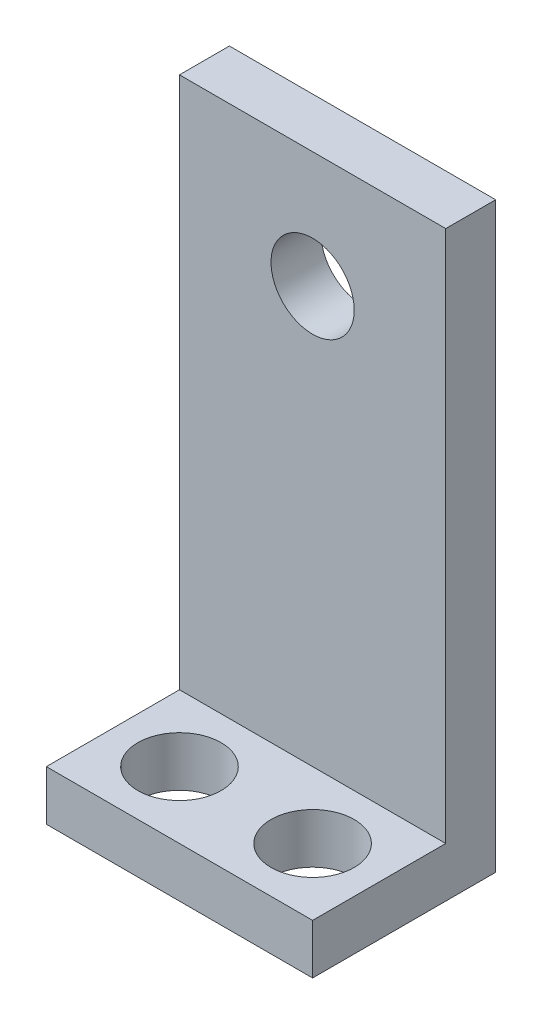
ISO-10303-21;
HEADER;
FILE_DESCRIPTION(('STEP AP214'),'2;1');
FILE_NAME('part.step','',(''),(''),'','','');
FILE_SCHEMA(('AUTOMOTIVE_DESIGN { 1 0 10303 214 1 1 1 1 }'));
ENDSEC;
DATA;
#1=APPLICATION_CONTEXT('core data for automotive mechanical design processes');
#2=APPLICATION_PROTOCOL_DEFINITION('international standard','automotive_design',2000,#1);
#3=PRODUCT_CONTEXT('',#1,'mechanical');
#4=PRODUCT('Part','Part','',(#3));
#5=PRODUCT_RELATED_PRODUCT_CATEGORY('part','',(#4));
#6=PRODUCT_DEFINITION_FORMATION('','',#4);
#7=PRODUCT_DEFINITION_CONTEXT('part definition',#1,'design');
#8=PRODUCT_DEFINITION('design','',#6,#7);
#9=PRODUCT_DEFINITION_SHAPE('','',#8);
#10=(LENGTH_UNIT() NAMED_UNIT(*) SI_UNIT(.MILLI.,.METRE.));
#11=(NAMED_UNIT(*) PLANE_ANGLE_UNIT() SI_UNIT($,.RADIAN.));
#12=(NAMED_UNIT(*) SI_UNIT($,.STERADIAN.) SOLID_ANGLE_UNIT());
#13=UNCERTAINTY_MEASURE_WITH_UNIT(LENGTH_MEASURE(1.E-05),#10,'distance_accuracy_value','');
#14=(GEOMETRIC_REPRESENTATION_CONTEXT(3) GLOBAL_UNCERTAINTY_ASSIGNED_CONTEXT((#13)) GLOBAL_UNIT_ASSIGNED_CONTEXT((#10,
#11,#12)) REPRESENTATION_CONTEXT('',''));
#15=CARTESIAN_POINT('',(0.,0.,0.));
#16=DIRECTION('',(0.,0.,1.));
#17=DIRECTION('',(1.,0.,0.));
#18=AXIS2_PLACEMENT_3D('',#15,#16,#17);
#19=CARTESIAN_POINT('',(8.,35.,0.));
#20=DIRECTION('',(1.,0.,0.));
#21=DIRECTION('',(0.,0.,-1.));
#22=AXIS2_PLACEMENT_3D('',#19,#20,#21);
#23=PLANE('',#22);
#24=DIRECTION('',(0.,0.,1.));
#25=VECTOR('',#24,1.);
#26=CARTESIAN_POINT('',(8.,0.,0.));
#27=LINE('',#26,#25);
#28=CARTESIAN_POINT('',(8.,0.,-5.5));
#29=VERTEX_POINT('',#28);
#30=CARTESIAN_POINT('',(8.,0.,5.5));
#31=VERTEX_POINT('',#30);
#32=EDGE_CURVE('E121',#29,#31,#27,.T.);
#33=ORIENTED_EDGE('',*,*,#32,.F.);
#34=DIRECTION('',(0.,-1.,0.));
#35=VECTOR('',#34,1.);
#36=CARTESIAN_POINT('',(8.,35.,-5.5));
#37=LINE('',#36,#35);
#38=CARTESIAN_POINT('',(8.,35.,-5.5));
#39=VERTEX_POINT('',#38);
#40=EDGE_CURVE('E11',#39,#29,#37,.T.);
#41=ORIENTED_EDGE('',*,*,#40,.F.);
#42=DIRECTION('',(0.,0.,1.));
#43=VECTOR('',#42,1.);
#44=CARTESIAN_POINT('',(8.,35.,0.));
#45=LINE('',#44,#43);
#46=CARTESIAN_POINT('',(8.,35.,-2.5));
#47=VERTEX_POINT('',#46);
#48=EDGE_CURVE('E117',#39,#47,#45,.T.);
#49=ORIENTED_EDGE('',*,*,#48,.T.);
#50=DIRECTION('',(0.,-1.,0.));
#51=VECTOR('',#50,1.);
#52=CARTESIAN_POINT('',(8.,35.,-2.5));
#53=LINE('',#52,#51);
#54=CARTESIAN_POINT('',(8.,3.,-2.5));
#55=VERTEX_POINT('',#54);
#56=EDGE_CURVE('E111',#47,#55,#53,.T.);
#57=ORIENTED_EDGE('',*,*,#56,.T.);
#58=DIRECTION('',(0.,0.,1.));
#59=VECTOR('',#58,1.);
#60=CARTESIAN_POINT('',(8.,3.,0.));
#61=LINE('',#60,#59);
#62=CARTESIAN_POINT('',(8.,3.,5.5));
#63=VERTEX_POINT('',#62);
#64=EDGE_CURVE('E52',#55,#63,#61,.T.);
#65=ORIENTED_EDGE('',*,*,#64,.T.);
#66=DIRECTION('',(0.,-1.,0.));
#67=VECTOR('',#66,1.);
#68=CARTESIAN_POINT('',(8.,3.,5.5));
#69=LINE('',#68,#67);
#70=EDGE_CURVE('E131',#63,#31,#69,.T.);
#71=ORIENTED_EDGE('',*,*,#70,.T.);
#72=EDGE_LOOP('',(#33,#41,#49,#57,#65,#71));
#73=FACE_BOUND('',#72,.T.);
#74=ADVANCED_FACE('F38',(#73),#23,.T.);
#75=CARTESIAN_POINT('',(0.,35.,-5.5));
#76=DIRECTION('',(0.,0.,-1.));
#77=DIRECTION('',(-1.,0.,0.));
#78=AXIS2_PLACEMENT_3D('',#75,#76,#77);
#79=PLANE('',#78);
#80=CARTESIAN_POINT('',(0.,28.,-5.5));
#81=DIRECTION('',(0.,0.,-1.));
#82=DIRECTION('',(-1.,0.,0.));
#83=AXIS2_PLACEMENT_3D('',#80,#81,#82);
#84=CIRCLE('',#83,2.5);
#85=CARTESIAN_POINT('',(-2.5,28.,-5.5));
#86=VERTEX_POINT('',#85);
#87=EDGE_CURVE('E144',#86,#86,#84,.T.);
#88=ORIENTED_EDGE('',*,*,#87,.F.);
#89=EDGE_LOOP('',(#88));
#90=FACE_BOUND('',#89,.T.);
#91=DIRECTION('',(1.,0.,0.));
#92=VECTOR('',#91,1.);
#93=CARTESIAN_POINT('',(0.,0.,-5.5));
#94=LINE('',#93,#92);
#95=CARTESIAN_POINT('',(-8.,0.,-5.5));
#96=VERTEX_POINT('',#95);
#97=EDGE_CURVE('E118',#96,#29,#94,.T.);
#98=ORIENTED_EDGE('',*,*,#97,.F.);
#99=DIRECTION('',(0.,-1.,0.));
#100=VECTOR('',#99,1.);
#101=CARTESIAN_POINT('',(-8.,35.,-5.5));
#102=LINE('',#101,#100);
#103=CARTESIAN_POINT('',(-8.,35.,-5.5));
#104=VERTEX_POINT('',#103);
#105=EDGE_CURVE('E45',#104,#96,#102,.T.);
#106=ORIENTED_EDGE('',*,*,#105,.F.);
#107=DIRECTION('',(1.,0.,0.));
#108=VECTOR('',#107,1.);
#109=CARTESIAN_POINT('',(0.,35.,-5.5));
#110=LINE('',#109,#108);
#111=EDGE_CURVE('E126',#104,#39,#110,.T.);
#112=ORIENTED_EDGE('',*,*,#111,.T.);
#113=ORIENTED_EDGE('',*,*,#40,.T.);
#114=EDGE_LOOP('',(#98,#106,#112,#113));
#115=FACE_BOUND('',#114,.T.);
#116=ADVANCED_FACE('F169',(#90,#115),#79,.T.);
#117=CARTESIAN_POINT('',(-8.,35.,0.));
#118=DIRECTION('',(1.,0.,0.));
#119=DIRECTION('',(0.,0.,-1.));
#120=AXIS2_PLACEMENT_3D('',#117,#118,#119);
#121=PLANE('',#120);
#122=DIRECTION('',(0.,0.,1.));
#123=VECTOR('',#122,1.);
#124=CARTESIAN_POINT('',(-8.,0.,0.));
#125=LINE('',#124,#123);
#126=CARTESIAN_POINT('',(-8.,0.,5.5));
#127=VERTEX_POINT('',#126);
#128=EDGE_CURVE('E115',#96,#127,#125,.T.);
#129=ORIENTED_EDGE('',*,*,#128,.T.);
#130=DIRECTION('',(0.,-1.,0.));
#131=VECTOR('',#130,1.);
#132=CARTESIAN_POINT('',(-8.,3.,5.5));
#133=LINE('',#132,#131);
#134=CARTESIAN_POINT('',(-8.,3.,5.5));
#135=VERTEX_POINT('',#134);
#136=EDGE_CURVE('E102',#135,#127,#133,.T.);
#137=ORIENTED_EDGE('',*,*,#136,.F.);
#138=DIRECTION('',(0.,0.,1.));
#139=VECTOR('',#138,1.);
#140=CARTESIAN_POINT('',(-8.,3.,0.));
#141=LINE('',#140,#139);
#142=CARTESIAN_POINT('',(-8.,3.,-2.5));
#143=VERTEX_POINT('',#142);
#144=EDGE_CURVE('E97',#143,#135,#141,.T.);
#145=ORIENTED_EDGE('',*,*,#144,.F.);
#146=DIRECTION('',(0.,-1.,0.));
#147=VECTOR('',#146,1.);
#148=CARTESIAN_POINT('',(-8.,35.,-2.5));
#149=LINE('',#148,#147);
#150=CARTESIAN_POINT('',(-8.,35.,-2.5));
#151=VERTEX_POINT('',#150);
#152=EDGE_CURVE('E100',#151,#143,#149,.T.);
#153=ORIENTED_EDGE('',*,*,#152,.F.);
#154=DIRECTION('',(0.,0.,1.));
#155=VECTOR('',#154,1.);
#156=CARTESIAN_POINT('',(-8.,35.,0.));
#157=LINE('',#156,#155);
#158=EDGE_CURVE('E124',#104,#151,#157,.T.);
#159=ORIENTED_EDGE('',*,*,#158,.F.);
#160=ORIENTED_EDGE('',*,*,#105,.T.);
#161=EDGE_LOOP('',(#129,#137,#145,#153,#159,#160));
#162=FACE_BOUND('',#161,.T.);
#163=ADVANCED_FACE('F98',(#162),#121,.F.);
#164=CARTESIAN_POINT('',(0.,35.,-2.5));
#165=DIRECTION('',(0.,0.,-1.));
#166=DIRECTION('',(-1.,0.,0.));
#167=AXIS2_PLACEMENT_3D('',#164,#165,#166);
#168=PLANE('',#167);
#169=CARTESIAN_POINT('',(0.,28.,-2.5));
#170=DIRECTION('',(0.,0.,1.));
#171=DIRECTION('',(1.,0.,0.));
#172=AXIS2_PLACEMENT_3D('',#169,#170,#171);
#173=CIRCLE('',#172,2.5);
#174=CARTESIAN_POINT('',(2.5,28.,-2.5));
#175=VERTEX_POINT('',#174);
#176=EDGE_CURVE('E154',#175,#175,#173,.T.);
#177=ORIENTED_EDGE('',*,*,#176,.F.);
#178=EDGE_LOOP('',(#177));
#179=FACE_BOUND('',#178,.T.);
#180=ORIENTED_EDGE('',*,*,#152,.T.);
#181=DIRECTION('',(1.,0.,0.));
#182=VECTOR('',#181,1.);
#183=CARTESIAN_POINT('',(0.,3.,-2.5));
#184=LINE('',#183,#182);
#185=EDGE_CURVE('E104',#143,#55,#184,.T.);
#186=ORIENTED_EDGE('',*,*,#185,.T.);
#187=ORIENTED_EDGE('',*,*,#56,.F.);
#188=DIRECTION('',(1.,0.,0.));
#189=VECTOR('',#188,1.);
#190=CARTESIAN_POINT('',(0.,35.,-2.5));
#191=LINE('',#190,#189);
#192=EDGE_CURVE('E61',#151,#47,#191,.T.);
#193=ORIENTED_EDGE('',*,*,#192,.F.);
#194=EDGE_LOOP('',(#180,#186,#187,#193));
#195=FACE_BOUND('',#194,.T.);
#196=ADVANCED_FACE('F110',(#179,#195),#168,.F.);
#197=CARTESIAN_POINT('',(0.,35.,0.));
#198=DIRECTION('',(0.,1.,0.));
#199=DIRECTION('',(0.,0.,1.));
#200=AXIS2_PLACEMENT_3D('',#197,#198,#199);
#201=PLANE('',#200);
#202=ORIENTED_EDGE('',*,*,#48,.F.);
#203=ORIENTED_EDGE('',*,*,#111,.F.);
#204=ORIENTED_EDGE('',*,*,#158,.T.);
#205=ORIENTED_EDGE('',*,*,#192,.T.);
#206=EDGE_LOOP('',(#202,#203,#204,#205));
#207=FACE_BOUND('',#206,.T.);
#208=ADVANCED_FACE('F161',(#207),#201,.T.);
#209=CARTESIAN_POINT('',(0.,0.,0.));
#210=DIRECTION('',(0.,1.,0.));
#211=DIRECTION('',(0.,0.,1.));
#212=AXIS2_PLACEMENT_3D('',#209,#210,#211);
#213=PLANE('',#212);
#214=ORIENTED_EDGE('',*,*,#32,.T.);
#215=DIRECTION('',(1.,0.,0.));
#216=VECTOR('',#215,1.);
#217=CARTESIAN_POINT('',(0.,0.,5.5));
#218=LINE('',#217,#216);
#219=EDGE_CURVE('E134',#127,#31,#218,.T.);
#220=ORIENTED_EDGE('',*,*,#219,.F.);
#221=ORIENTED_EDGE('',*,*,#128,.F.);
#222=ORIENTED_EDGE('',*,*,#97,.T.);
#223=EDGE_LOOP('',(#214,#220,#221,#222));
#224=FACE_BOUND('',#223,.T.);
#225=CARTESIAN_POINT('',(-4.,0.,1.5));
#226=DIRECTION('',(0.,1.,0.));
#227=DIRECTION('',(0.,0.,1.));
#228=AXIS2_PLACEMENT_3D('',#225,#226,#227);
#229=CIRCLE('',#228,2.5);
#230=CARTESIAN_POINT('',(-4.,0.,4.));
#231=VERTEX_POINT('',#230);
#232=EDGE_CURVE('E141',#231,#231,#229,.T.);
#233=ORIENTED_EDGE('',*,*,#232,.T.);
#234=EDGE_LOOP('',(#233));
#235=FACE_BOUND('',#234,.T.);
#236=CARTESIAN_POINT('',(4.,0.,1.5));
#237=DIRECTION('',(0.,1.,0.));
#238=DIRECTION('',(0.,0.,1.));
#239=AXIS2_PLACEMENT_3D('',#236,#237,#238);
#240=CIRCLE('',#239,2.5);
#241=CARTESIAN_POINT('',(4.,0.,4.));
#242=VERTEX_POINT('',#241);
#243=EDGE_CURVE('E138',#242,#242,#240,.T.);
#244=ORIENTED_EDGE('',*,*,#243,.T.);
#245=EDGE_LOOP('',(#244));
#246=FACE_BOUND('',#245,.T.);
#247=ADVANCED_FACE('F167',(#224,#235,#246),#213,.F.);
#248=CARTESIAN_POINT('',(4.,3.,1.5));
#249=DIRECTION('',(0.,-1.,0.));
#250=DIRECTION('',(0.,0.,-1.));
#251=AXIS2_PLACEMENT_3D('',#248,#249,#250);
#252=CYLINDRICAL_SURFACE('',#251,2.5);
#253=CARTESIAN_POINT('',(4.,3.,1.5));
#254=DIRECTION('',(0.,1.,0.));
#255=DIRECTION('',(0.,0.,1.));
#256=AXIS2_PLACEMENT_3D('',#253,#254,#255);
#257=CIRCLE('',#256,2.5);
#258=CARTESIAN_POINT('',(4.,3.,4.));
#259=VERTEX_POINT('',#258);
#260=EDGE_CURVE('E147',#259,#259,#257,.T.);
#261=ORIENTED_EDGE('',*,*,#260,.T.);
#262=EDGE_LOOP('',(#261));
#263=FACE_BOUND('',#262,.T.);
#264=ORIENTED_EDGE('',*,*,#243,.F.);
#265=EDGE_LOOP('',(#264));
#266=FACE_BOUND('',#265,.T.);
#267=ADVANCED_FACE('F195',(#263,#266),#252,.F.);
#268=CARTESIAN_POINT('',(-4.,3.,1.5));
#269=DIRECTION('',(0.,-1.,0.));
#270=DIRECTION('',(0.,0.,-1.));
#271=AXIS2_PLACEMENT_3D('',#268,#269,#270);
#272=CYLINDRICAL_SURFACE('',#271,2.5);
#273=CARTESIAN_POINT('',(-4.,3.,1.5));
#274=DIRECTION('',(0.,1.,0.));
#275=DIRECTION('',(0.,0.,1.));
#276=AXIS2_PLACEMENT_3D('',#273,#274,#275);
#277=CIRCLE('',#276,2.5);
#278=CARTESIAN_POINT('',(-4.,3.,4.));
#279=VERTEX_POINT('',#278);
#280=EDGE_CURVE('E137',#279,#279,#277,.T.);
#281=ORIENTED_EDGE('',*,*,#280,.T.);
#282=EDGE_LOOP('',(#281));
#283=FACE_BOUND('',#282,.T.);
#284=ORIENTED_EDGE('',*,*,#232,.F.);
#285=EDGE_LOOP('',(#284));
#286=FACE_BOUND('',#285,.T.);
#287=ADVANCED_FACE('F187',(#283,#286),#272,.F.);
#288=CARTESIAN_POINT('',(0.,3.,5.5));
#289=DIRECTION('',(0.,0.,-1.));
#290=DIRECTION('',(-1.,0.,0.));
#291=AXIS2_PLACEMENT_3D('',#288,#289,#290);
#292=PLANE('',#291);
#293=ORIENTED_EDGE('',*,*,#219,.T.);
#294=ORIENTED_EDGE('',*,*,#70,.F.);
#295=DIRECTION('',(1.,0.,0.));
#296=VECTOR('',#295,1.);
#297=CARTESIAN_POINT('',(0.,3.,5.5));
#298=LINE('',#297,#296);
#299=EDGE_CURVE('E103',#135,#63,#298,.T.);
#300=ORIENTED_EDGE('',*,*,#299,.F.);
#301=ORIENTED_EDGE('',*,*,#136,.T.);
#302=EDGE_LOOP('',(#293,#294,#300,#301));
#303=FACE_BOUND('',#302,.T.);
#304=ADVANCED_FACE('F185',(#303),#292,.F.);
#305=CARTESIAN_POINT('',(0.,3.,0.));
#306=DIRECTION('',(0.,1.,0.));
#307=DIRECTION('',(0.,0.,1.));
#308=AXIS2_PLACEMENT_3D('',#305,#306,#307);
#309=PLANE('',#308);
#310=ORIENTED_EDGE('',*,*,#280,.F.);
#311=EDGE_LOOP('',(#310));
#312=FACE_BOUND('',#311,.T.);
#313=ORIENTED_EDGE('',*,*,#260,.F.);
#314=EDGE_LOOP('',(#313));
#315=FACE_BOUND('',#314,.T.);
#316=ORIENTED_EDGE('',*,*,#64,.F.);
#317=ORIENTED_EDGE('',*,*,#185,.F.);
#318=ORIENTED_EDGE('',*,*,#144,.T.);
#319=ORIENTED_EDGE('',*,*,#299,.T.);
#320=EDGE_LOOP('',(#316,#317,#318,#319));
#321=FACE_BOUND('',#320,.T.);
#322=ADVANCED_FACE('F106',(#312,#315,#321),#309,.T.);
#323=CARTESIAN_POINT('',(0.,28.,-10.5));
#324=DIRECTION('',(0.,0.,1.));
#325=DIRECTION('',(1.,0.,0.));
#326=AXIS2_PLACEMENT_3D('',#323,#324,#325);
#327=CYLINDRICAL_SURFACE('',#326,2.5);
#328=ORIENTED_EDGE('',*,*,#87,.T.);
#329=EDGE_LOOP('',(#328));
#330=FACE_BOUND('',#329,.T.);
#331=ORIENTED_EDGE('',*,*,#176,.T.);
#332=EDGE_LOOP('',(#331));
#333=FACE_BOUND('',#332,.T.);
#334=ADVANCED_FACE('F158',(#330,#333),#327,.F.);
#335=CLOSED_SHELL('',(#74,#116,#163,#196,#208,#247,#267,#287,#304,#322,#334));
#336=MANIFOLD_SOLID_BREP('B2',#335);
#337=ADVANCED_BREP_SHAPE_REPRESENTATION('',(#18,#336),#14);
#338=SHAPE_DEFINITION_REPRESENTATION(#9,#337);
ENDSEC;
END-ISO-10303-21;
